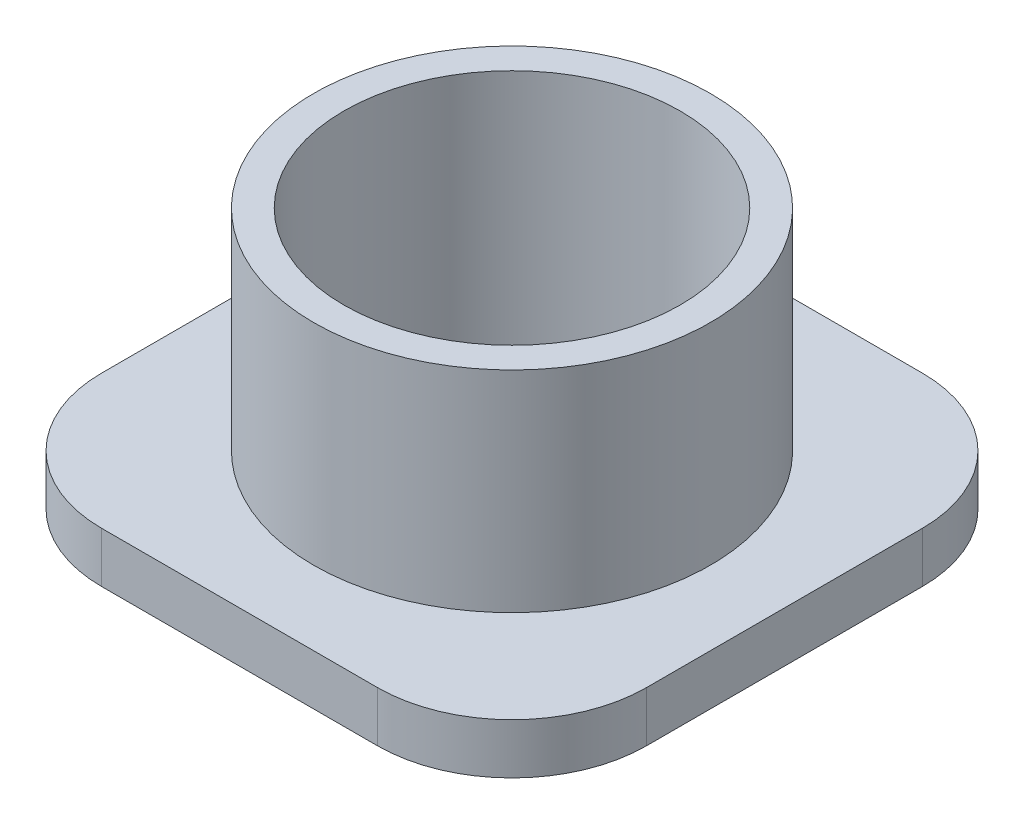
ISO-10303-21;
HEADER;
FILE_DESCRIPTION(('STEP AP214'),'2;1');
FILE_NAME('part.step','',(''),(''),'','','');
FILE_SCHEMA(('AUTOMOTIVE_DESIGN { 1 0 10303 214 1 1 1 1 }'));
ENDSEC;
DATA;
#1=APPLICATION_CONTEXT('core data for automotive mechanical design processes');
#2=APPLICATION_PROTOCOL_DEFINITION('international standard','automotive_design',2000,#1);
#3=PRODUCT_CONTEXT('',#1,'mechanical');
#4=PRODUCT('Part','Part','',(#3));
#5=PRODUCT_RELATED_PRODUCT_CATEGORY('part','',(#4));
#6=PRODUCT_DEFINITION_FORMATION('','',#4);
#7=PRODUCT_DEFINITION_CONTEXT('part definition',#1,'design');
#8=PRODUCT_DEFINITION('design','',#6,#7);
#9=PRODUCT_DEFINITION_SHAPE('','',#8);
#10=(LENGTH_UNIT() NAMED_UNIT(*) SI_UNIT(.MILLI.,.METRE.));
#11=(NAMED_UNIT(*) PLANE_ANGLE_UNIT() SI_UNIT($,.RADIAN.));
#12=(NAMED_UNIT(*) SI_UNIT($,.STERADIAN.) SOLID_ANGLE_UNIT());
#13=UNCERTAINTY_MEASURE_WITH_UNIT(LENGTH_MEASURE(1.E-05),#10,'distance_accuracy_value','');
#14=(GEOMETRIC_REPRESENTATION_CONTEXT(3) GLOBAL_UNCERTAINTY_ASSIGNED_CONTEXT((#13)) GLOBAL_UNIT_ASSIGNED_CONTEXT((#10,
#11,#12)) REPRESENTATION_CONTEXT('',''));
#15=CARTESIAN_POINT('',(0.,0.,0.));
#16=DIRECTION('',(0.,0.,1.));
#17=DIRECTION('',(1.,0.,0.));
#18=AXIS2_PLACEMENT_3D('',#15,#16,#17);
#19=CARTESIAN_POINT('',(0.,19.685,0.));
#20=DIRECTION('',(0.,-1.,0.));
#21=DIRECTION('',(0.,0.,-1.));
#22=AXIS2_PLACEMENT_3D('',#19,#20,#21);
#23=CYLINDRICAL_SURFACE('',#22,14.986);
#24=CARTESIAN_POINT('',(0.,19.685,0.));
#25=DIRECTION('',(0.,1.,0.));
#26=DIRECTION('',(0.,0.,1.));
#27=AXIS2_PLACEMENT_3D('',#24,#25,#26);
#28=CIRCLE('',#27,14.986);
#29=CARTESIAN_POINT('',(0.,19.685,14.986));
#30=VERTEX_POINT('',#29);
#31=EDGE_CURVE('E118',#30,#30,#28,.T.);
#32=ORIENTED_EDGE('',*,*,#31,.F.);
#33=EDGE_LOOP('',(#32));
#34=FACE_BOUND('',#33,.T.);
#35=CARTESIAN_POINT('',(0.,3.81,0.));
#36=DIRECTION('',(0.,-1.,0.));
#37=DIRECTION('',(0.,0.,-1.));
#38=AXIS2_PLACEMENT_3D('',#35,#36,#37);
#39=CIRCLE('',#38,14.986);
#40=CARTESIAN_POINT('',(0.,3.81,-14.986));
#41=VERTEX_POINT('',#40);
#42=EDGE_CURVE('E11',#41,#41,#39,.F.);
#43=ORIENTED_EDGE('',*,*,#42,.T.);
#44=EDGE_LOOP('',(#43));
#45=FACE_BOUND('',#44,.T.);
#46=ADVANCED_FACE('F34',(#34,#45),#23,.T.);
#47=CARTESIAN_POINT('',(0.,19.685,0.));
#48=DIRECTION('',(0.,1.,0.));
#49=DIRECTION('',(0.,0.,1.));
#50=AXIS2_PLACEMENT_3D('',#47,#48,#49);
#51=PLANE('',#50);
#52=CARTESIAN_POINT('',(0.,19.685,0.));
#53=DIRECTION('',(0.,1.,0.));
#54=DIRECTION('',(0.,0.,1.));
#55=AXIS2_PLACEMENT_3D('',#52,#53,#54);
#56=CIRCLE('',#55,12.7);
#57=CARTESIAN_POINT('',(0.,19.685,12.7));
#58=VERTEX_POINT('',#57);
#59=EDGE_CURVE('E183',#58,#58,#56,.T.);
#60=ORIENTED_EDGE('',*,*,#59,.F.);
#61=EDGE_LOOP('',(#60));
#62=FACE_BOUND('',#61,.T.);
#63=ORIENTED_EDGE('',*,*,#31,.T.);
#64=EDGE_LOOP('',(#63));
#65=FACE_BOUND('',#64,.T.);
#66=ADVANCED_FACE('F189',(#62,#65),#51,.T.);
#67=CARTESIAN_POINT('',(10.414,3.81,-10.414));
#68=DIRECTION('',(0.,-1.,0.));
#69=DIRECTION('',(0.,0.,-1.));
#70=AXIS2_PLACEMENT_3D('',#67,#68,#69);
#71=PLANE('',#70);
#72=CARTESIAN_POINT('',(10.414,3.81,-10.414));
#73=DIRECTION('',(0.,-1.,0.));
#74=DIRECTION('',(0.,0.,-1.));
#75=AXIS2_PLACEMENT_3D('',#72,#73,#74);
#76=CIRCLE('',#75,10.16);
#77=CARTESIAN_POINT('',(10.414,3.81,-20.574));
#78=VERTEX_POINT('',#77);
#79=CARTESIAN_POINT('',(20.574,3.81,-10.414));
#80=VERTEX_POINT('',#79);
#81=EDGE_CURVE('E102',#78,#80,#76,.T.);
#82=ORIENTED_EDGE('',*,*,#81,.F.);
#83=DIRECTION('',(1.,0.,0.));
#84=VECTOR('',#83,1.);
#85=CARTESIAN_POINT('',(-10.414,3.81,-20.574));
#86=LINE('',#85,#84);
#87=CARTESIAN_POINT('',(-10.414,3.81,-20.574));
#88=VERTEX_POINT('',#87);
#89=EDGE_CURVE('E108',#88,#78,#86,.T.);
#90=ORIENTED_EDGE('',*,*,#89,.F.);
#91=CARTESIAN_POINT('',(-10.414,3.81,-10.414));
#92=DIRECTION('',(0.,-1.,0.));
#93=DIRECTION('',(0.,0.,-1.));
#94=AXIS2_PLACEMENT_3D('',#91,#92,#93);
#95=CIRCLE('',#94,10.16);
#96=CARTESIAN_POINT('',(-20.574,3.81,-10.414));
#97=VERTEX_POINT('',#96);
#98=EDGE_CURVE('E128',#97,#88,#95,.T.);
#99=ORIENTED_EDGE('',*,*,#98,.F.);
#100=DIRECTION('',(0.,0.,1.));
#101=VECTOR('',#100,1.);
#102=CARTESIAN_POINT('',(-20.574,3.81,-10.414));
#103=LINE('',#102,#101);
#104=CARTESIAN_POINT('',(-20.574,3.81,10.414));
#105=VERTEX_POINT('',#104);
#106=EDGE_CURVE('E130',#97,#105,#103,.T.);
#107=ORIENTED_EDGE('',*,*,#106,.T.);
#108=CARTESIAN_POINT('',(-10.414,3.81,10.414));
#109=DIRECTION('',(0.,1.,0.));
#110=DIRECTION('',(0.,0.,1.));
#111=AXIS2_PLACEMENT_3D('',#108,#109,#110);
#112=CIRCLE('',#111,10.16);
#113=CARTESIAN_POINT('',(-10.414,3.81,20.574));
#114=VERTEX_POINT('',#113);
#115=EDGE_CURVE('E133',#105,#114,#112,.T.);
#116=ORIENTED_EDGE('',*,*,#115,.T.);
#117=DIRECTION('',(-1.,0.,0.));
#118=VECTOR('',#117,1.);
#119=CARTESIAN_POINT('',(10.414,3.81,20.574));
#120=LINE('',#119,#118);
#121=CARTESIAN_POINT('',(10.414,3.81,20.574));
#122=VERTEX_POINT('',#121);
#123=EDGE_CURVE('E136',#122,#114,#120,.T.);
#124=ORIENTED_EDGE('',*,*,#123,.F.);
#125=CARTESIAN_POINT('',(10.414,3.81,10.414));
#126=DIRECTION('',(0.,-1.,0.));
#127=DIRECTION('',(0.,0.,-1.));
#128=AXIS2_PLACEMENT_3D('',#125,#126,#127);
#129=CIRCLE('',#128,10.16);
#130=CARTESIAN_POINT('',(20.574,3.81,10.414));
#131=VERTEX_POINT('',#130);
#132=EDGE_CURVE('E139',#131,#122,#129,.T.);
#133=ORIENTED_EDGE('',*,*,#132,.F.);
#134=DIRECTION('',(0.,0.,-1.));
#135=VECTOR('',#134,1.);
#136=CARTESIAN_POINT('',(20.574,3.81,10.414));
#137=LINE('',#136,#135);
#138=EDGE_CURVE('E142',#131,#80,#137,.T.);
#139=ORIENTED_EDGE('',*,*,#138,.T.);
#140=EDGE_LOOP('',(#82,#90,#99,#107,#116,#124,#133,#139));
#141=FACE_BOUND('',#140,.T.);
#142=ORIENTED_EDGE('',*,*,#42,.F.);
#143=EDGE_LOOP('',(#142));
#144=FACE_BOUND('',#143,.T.);
#145=ADVANCED_FACE('F157',(#141,#144),#71,.F.);
#146=CARTESIAN_POINT('',(10.414,3.81,-10.414));
#147=DIRECTION('',(0.,-1.,0.));
#148=DIRECTION('',(0.,0.,-1.));
#149=AXIS2_PLACEMENT_3D('',#146,#147,#148);
#150=CYLINDRICAL_SURFACE('',#149,10.16);
#151=DIRECTION('',(0.,-1.,0.));
#152=VECTOR('',#151,1.);
#153=CARTESIAN_POINT('',(10.414,3.81,-20.574));
#154=LINE('',#153,#152);
#155=CARTESIAN_POINT('',(10.414,0.,-20.574));
#156=VERTEX_POINT('',#155);
#157=EDGE_CURVE('E42',#78,#156,#154,.T.);
#158=ORIENTED_EDGE('',*,*,#157,.F.);
#159=ORIENTED_EDGE('',*,*,#81,.T.);
#160=DIRECTION('',(0.,-1.,0.));
#161=VECTOR('',#160,1.);
#162=CARTESIAN_POINT('',(20.574,3.81,-10.414));
#163=LINE('',#162,#161);
#164=CARTESIAN_POINT('',(20.574,0.,-10.414));
#165=VERTEX_POINT('',#164);
#166=EDGE_CURVE('E97',#80,#165,#163,.T.);
#167=ORIENTED_EDGE('',*,*,#166,.T.);
#168=CARTESIAN_POINT('',(10.414,0.,-10.414));
#169=DIRECTION('',(0.,-1.,0.));
#170=DIRECTION('',(0.,0.,-1.));
#171=AXIS2_PLACEMENT_3D('',#168,#169,#170);
#172=CIRCLE('',#171,10.16);
#173=EDGE_CURVE('E100',#156,#165,#172,.T.);
#174=ORIENTED_EDGE('',*,*,#173,.F.);
#175=EDGE_LOOP('',(#158,#159,#167,#174));
#176=FACE_BOUND('',#175,.T.);
#177=ADVANCED_FACE('F99',(#176),#150,.T.);
#178=CARTESIAN_POINT('',(-10.414,3.81,-20.574));
#179=DIRECTION('',(0.,0.,-1.));
#180=DIRECTION('',(-1.,0.,0.));
#181=AXIS2_PLACEMENT_3D('',#178,#179,#180);
#182=PLANE('',#181);
#183=DIRECTION('',(0.,-1.,0.));
#184=VECTOR('',#183,1.);
#185=CARTESIAN_POINT('',(-10.414,3.81,-20.574));
#186=LINE('',#185,#184);
#187=CARTESIAN_POINT('',(-10.414,0.,-20.574));
#188=VERTEX_POINT('',#187);
#189=EDGE_CURVE('E56',#88,#188,#186,.T.);
#190=ORIENTED_EDGE('',*,*,#189,.F.);
#191=ORIENTED_EDGE('',*,*,#89,.T.);
#192=ORIENTED_EDGE('',*,*,#157,.T.);
#193=DIRECTION('',(1.,0.,0.));
#194=VECTOR('',#193,1.);
#195=CARTESIAN_POINT('',(-10.414,0.,-20.574));
#196=LINE('',#195,#194);
#197=EDGE_CURVE('E117',#188,#156,#196,.T.);
#198=ORIENTED_EDGE('',*,*,#197,.F.);
#199=EDGE_LOOP('',(#190,#191,#192,#198));
#200=FACE_BOUND('',#199,.T.);
#201=ADVANCED_FACE('F36',(#200),#182,.T.);
#202=CARTESIAN_POINT('',(-10.414,3.81,-10.414));
#203=DIRECTION('',(0.,-1.,0.));
#204=DIRECTION('',(0.,0.,-1.));
#205=AXIS2_PLACEMENT_3D('',#202,#203,#204);
#206=CYLINDRICAL_SURFACE('',#205,10.16);
#207=DIRECTION('',(0.,-1.,0.));
#208=VECTOR('',#207,1.);
#209=CARTESIAN_POINT('',(-20.574,3.81,-10.414));
#210=LINE('',#209,#208);
#211=CARTESIAN_POINT('',(-20.574,0.,-10.414));
#212=VERTEX_POINT('',#211);
#213=EDGE_CURVE('E152',#97,#212,#210,.T.);
#214=ORIENTED_EDGE('',*,*,#213,.F.);
#215=ORIENTED_EDGE('',*,*,#98,.T.);
#216=ORIENTED_EDGE('',*,*,#189,.T.);
#217=CARTESIAN_POINT('',(-10.414,0.,-10.414));
#218=DIRECTION('',(0.,-1.,0.));
#219=DIRECTION('',(0.,0.,-1.));
#220=AXIS2_PLACEMENT_3D('',#217,#218,#219);
#221=CIRCLE('',#220,10.16);
#222=EDGE_CURVE('E175',#212,#188,#221,.T.);
#223=ORIENTED_EDGE('',*,*,#222,.F.);
#224=EDGE_LOOP('',(#214,#215,#216,#223));
#225=FACE_BOUND('',#224,.T.);
#226=ADVANCED_FACE('F219',(#225),#206,.T.);
#227=CARTESIAN_POINT('',(-20.574,3.81,-10.414));
#228=DIRECTION('',(1.,0.,0.));
#229=DIRECTION('',(0.,0.,-1.));
#230=AXIS2_PLACEMENT_3D('',#227,#228,#229);
#231=PLANE('',#230);
#232=DIRECTION('',(0.,-1.,0.));
#233=VECTOR('',#232,1.);
#234=CARTESIAN_POINT('',(-20.574,3.81,10.414));
#235=LINE('',#234,#233);
#236=CARTESIAN_POINT('',(-20.574,0.,10.414));
#237=VERTEX_POINT('',#236);
#238=EDGE_CURVE('E150',#105,#237,#235,.T.);
#239=ORIENTED_EDGE('',*,*,#238,.F.);
#240=ORIENTED_EDGE('',*,*,#106,.F.);
#241=ORIENTED_EDGE('',*,*,#213,.T.);
#242=DIRECTION('',(0.,0.,1.));
#243=VECTOR('',#242,1.);
#244=CARTESIAN_POINT('',(-20.574,0.,-10.414));
#245=LINE('',#244,#243);
#246=EDGE_CURVE('E170',#212,#237,#245,.T.);
#247=ORIENTED_EDGE('',*,*,#246,.T.);
#248=EDGE_LOOP('',(#239,#240,#241,#247));
#249=FACE_BOUND('',#248,.T.);
#250=ADVANCED_FACE('F216',(#249),#231,.F.);
#251=CARTESIAN_POINT('',(-10.414,3.81,10.414));
#252=DIRECTION('',(0.,-1.,0.));
#253=DIRECTION('',(0.,0.,-1.));
#254=AXIS2_PLACEMENT_3D('',#251,#252,#253);
#255=CYLINDRICAL_SURFACE('',#254,10.16);
#256=DIRECTION('',(0.,-1.,0.));
#257=VECTOR('',#256,1.);
#258=CARTESIAN_POINT('',(-10.414,3.81,20.574));
#259=LINE('',#258,#257);
#260=CARTESIAN_POINT('',(-10.414,0.,20.574));
#261=VERTEX_POINT('',#260);
#262=EDGE_CURVE('E148',#114,#261,#259,.T.);
#263=ORIENTED_EDGE('',*,*,#262,.F.);
#264=ORIENTED_EDGE('',*,*,#115,.F.);
#265=ORIENTED_EDGE('',*,*,#238,.T.);
#266=CARTESIAN_POINT('',(-10.414,0.,10.414));
#267=DIRECTION('',(0.,1.,0.));
#268=DIRECTION('',(0.,0.,1.));
#269=AXIS2_PLACEMENT_3D('',#266,#267,#268);
#270=CIRCLE('',#269,10.16);
#271=EDGE_CURVE('E169',#237,#261,#270,.T.);
#272=ORIENTED_EDGE('',*,*,#271,.T.);
#273=EDGE_LOOP('',(#263,#264,#265,#272));
#274=FACE_BOUND('',#273,.T.);
#275=ADVANCED_FACE('F213',(#274),#255,.T.);
#276=CARTESIAN_POINT('',(10.414,3.81,20.574));
#277=DIRECTION('',(0.,0.,1.));
#278=DIRECTION('',(1.,0.,0.));
#279=AXIS2_PLACEMENT_3D('',#276,#277,#278);
#280=PLANE('',#279);
#281=DIRECTION('',(0.,-1.,0.));
#282=VECTOR('',#281,1.);
#283=CARTESIAN_POINT('',(10.414,3.81,20.574));
#284=LINE('',#283,#282);
#285=CARTESIAN_POINT('',(10.414,0.,20.574));
#286=VERTEX_POINT('',#285);
#287=EDGE_CURVE('E146',#122,#286,#284,.T.);
#288=ORIENTED_EDGE('',*,*,#287,.F.);
#289=ORIENTED_EDGE('',*,*,#123,.T.);
#290=ORIENTED_EDGE('',*,*,#262,.T.);
#291=DIRECTION('',(-1.,0.,0.));
#292=VECTOR('',#291,1.);
#293=CARTESIAN_POINT('',(10.414,0.,20.574));
#294=LINE('',#293,#292);
#295=EDGE_CURVE('E123',#286,#261,#294,.T.);
#296=ORIENTED_EDGE('',*,*,#295,.F.);
#297=EDGE_LOOP('',(#288,#289,#290,#296));
#298=FACE_BOUND('',#297,.T.);
#299=ADVANCED_FACE('F168',(#298),#280,.T.);
#300=CARTESIAN_POINT('',(10.414,3.81,10.414));
#301=DIRECTION('',(0.,-1.,0.));
#302=DIRECTION('',(0.,0.,-1.));
#303=AXIS2_PLACEMENT_3D('',#300,#301,#302);
#304=CYLINDRICAL_SURFACE('',#303,10.16);
#305=DIRECTION('',(0.,-1.,0.));
#306=VECTOR('',#305,1.);
#307=CARTESIAN_POINT('',(20.574,3.81,10.414));
#308=LINE('',#307,#306);
#309=CARTESIAN_POINT('',(20.574,0.,10.414));
#310=VERTEX_POINT('',#309);
#311=EDGE_CURVE('E107',#131,#310,#308,.T.);
#312=ORIENTED_EDGE('',*,*,#311,.F.);
#313=ORIENTED_EDGE('',*,*,#132,.T.);
#314=ORIENTED_EDGE('',*,*,#287,.T.);
#315=CARTESIAN_POINT('',(10.414,0.,10.414));
#316=DIRECTION('',(0.,-1.,0.));
#317=DIRECTION('',(0.,0.,-1.));
#318=AXIS2_PLACEMENT_3D('',#315,#316,#317);
#319=CIRCLE('',#318,10.16);
#320=EDGE_CURVE('E121',#310,#286,#319,.T.);
#321=ORIENTED_EDGE('',*,*,#320,.F.);
#322=EDGE_LOOP('',(#312,#313,#314,#321));
#323=FACE_BOUND('',#322,.T.);
#324=ADVANCED_FACE('F162',(#323),#304,.T.);
#325=CARTESIAN_POINT('',(20.574,3.81,10.414));
#326=DIRECTION('',(-1.,0.,0.));
#327=DIRECTION('',(0.,0.,1.));
#328=AXIS2_PLACEMENT_3D('',#325,#326,#327);
#329=PLANE('',#328);
#330=ORIENTED_EDGE('',*,*,#138,.F.);
#331=ORIENTED_EDGE('',*,*,#311,.T.);
#332=DIRECTION('',(0.,0.,-1.));
#333=VECTOR('',#332,1.);
#334=CARTESIAN_POINT('',(20.574,0.,10.414));
#335=LINE('',#334,#333);
#336=EDGE_CURVE('E114',#310,#165,#335,.T.);
#337=ORIENTED_EDGE('',*,*,#336,.T.);
#338=ORIENTED_EDGE('',*,*,#166,.F.);
#339=EDGE_LOOP('',(#330,#331,#337,#338));
#340=FACE_BOUND('',#339,.T.);
#341=ADVANCED_FACE('F120',(#340),#329,.F.);
#342=CARTESIAN_POINT('',(10.414,0.,-10.414));
#343=DIRECTION('',(0.,-1.,0.));
#344=DIRECTION('',(0.,0.,-1.));
#345=AXIS2_PLACEMENT_3D('',#342,#343,#344);
#346=PLANE('',#345);
#347=CARTESIAN_POINT('',(0.,0.,0.));
#348=DIRECTION('',(0.,1.,0.));
#349=DIRECTION('',(0.,0.,1.));
#350=AXIS2_PLACEMENT_3D('',#347,#348,#349);
#351=CIRCLE('',#350,12.7);
#352=CARTESIAN_POINT('',(0.,0.,12.7));
#353=VERTEX_POINT('',#352);
#354=EDGE_CURVE('E180',#353,#353,#351,.T.);
#355=ORIENTED_EDGE('',*,*,#354,.T.);
#356=EDGE_LOOP('',(#355));
#357=FACE_BOUND('',#356,.T.);
#358=ORIENTED_EDGE('',*,*,#173,.T.);
#359=ORIENTED_EDGE('',*,*,#336,.F.);
#360=ORIENTED_EDGE('',*,*,#320,.T.);
#361=ORIENTED_EDGE('',*,*,#295,.T.);
#362=ORIENTED_EDGE('',*,*,#271,.F.);
#363=ORIENTED_EDGE('',*,*,#246,.F.);
#364=ORIENTED_EDGE('',*,*,#222,.T.);
#365=ORIENTED_EDGE('',*,*,#197,.T.);
#366=EDGE_LOOP('',(#358,#359,#360,#361,#362,#363,#364,#365));
#367=FACE_BOUND('',#366,.T.);
#368=ADVANCED_FACE('F112',(#357,#367),#346,.T.);
#369=CARTESIAN_POINT('',(0.,0.,0.));
#370=DIRECTION('',(0.,1.,0.));
#371=DIRECTION('',(0.,0.,1.));
#372=AXIS2_PLACEMENT_3D('',#369,#370,#371);
#373=CYLINDRICAL_SURFACE('',#372,12.7);
#374=ORIENTED_EDGE('',*,*,#354,.F.);
#375=EDGE_LOOP('',(#374));
#376=FACE_BOUND('',#375,.T.);
#377=ORIENTED_EDGE('',*,*,#59,.T.);
#378=EDGE_LOOP('',(#377));
#379=FACE_BOUND('',#378,.T.);
#380=ADVANCED_FACE('F187',(#376,#379),#373,.F.);
#381=CLOSED_SHELL('',(#46,#66,#145,#177,#201,#226,#250,#275,#299,#324,#341,#368,#380));
#382=MANIFOLD_SOLID_BREP('B2',#381);
#383=ADVANCED_BREP_SHAPE_REPRESENTATION('',(#18,#382),#14);
#384=SHAPE_DEFINITION_REPRESENTATION(#9,#383);
ENDSEC;
END-ISO-10303-21;
